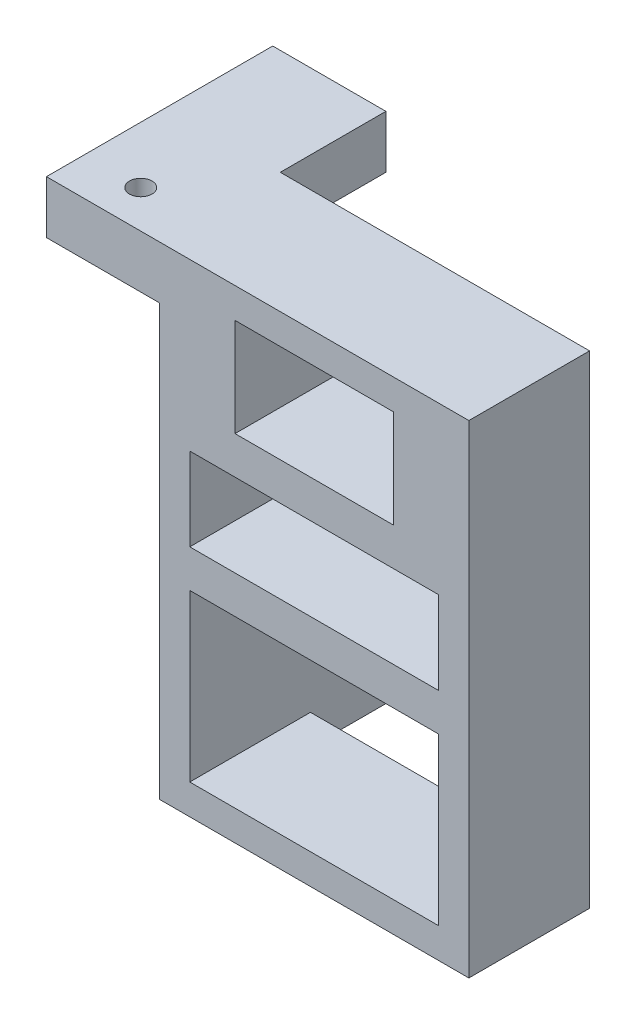
ISO-10303-21;
HEADER;
FILE_DESCRIPTION(('STEP AP214'),'2;1');
FILE_NAME('part.step','',(''),(''),'','','');
FILE_SCHEMA(('AUTOMOTIVE_DESIGN { 1 0 10303 214 1 1 1 1 }'));
ENDSEC;
DATA;
#1=APPLICATION_CONTEXT('core data for automotive mechanical design processes');
#2=APPLICATION_PROTOCOL_DEFINITION('international standard','automotive_design',2000,#1);
#3=PRODUCT_CONTEXT('',#1,'mechanical');
#4=PRODUCT('Part','Part','',(#3));
#5=PRODUCT_RELATED_PRODUCT_CATEGORY('part','',(#4));
#6=PRODUCT_DEFINITION_FORMATION('','',#4);
#7=PRODUCT_DEFINITION_CONTEXT('part definition',#1,'design');
#8=PRODUCT_DEFINITION('design','',#6,#7);
#9=PRODUCT_DEFINITION_SHAPE('','',#8);
#10=(LENGTH_UNIT() NAMED_UNIT(*) SI_UNIT(.MILLI.,.METRE.));
#11=(NAMED_UNIT(*) PLANE_ANGLE_UNIT() SI_UNIT($,.RADIAN.));
#12=(NAMED_UNIT(*) SI_UNIT($,.STERADIAN.) SOLID_ANGLE_UNIT());
#13=UNCERTAINTY_MEASURE_WITH_UNIT(LENGTH_MEASURE(1.E-05),#10,'distance_accuracy_value','');
#14=(GEOMETRIC_REPRESENTATION_CONTEXT(3) GLOBAL_UNCERTAINTY_ASSIGNED_CONTEXT((#13)) GLOBAL_UNIT_ASSIGNED_CONTEXT((#10,
#11,#12)) REPRESENTATION_CONTEXT('',''));
#15=CARTESIAN_POINT('',(0.,0.,0.));
#16=DIRECTION('',(0.,0.,1.));
#17=DIRECTION('',(1.,0.,0.));
#18=AXIS2_PLACEMENT_3D('',#15,#16,#17);
#19=CARTESIAN_POINT('',(0.,0.,0.));
#20=DIRECTION('',(0.,0.,1.));
#21=DIRECTION('',(1.,0.,0.));
#22=AXIS2_PLACEMENT_3D('',#19,#20,#21);
#23=PLANE('',#22);
#24=DIRECTION('',(0.,-1.,0.));
#25=VECTOR('',#24,1.);
#26=CARTESIAN_POINT('',(-93.4942398194444,40.0277777777778,0.));
#27=LINE('',#26,#25);
#28=CARTESIAN_POINT('',(-93.4942398194444,40.0277777777778,0.));
#29=VERTEX_POINT('',#28);
#30=CARTESIAN_POINT('',(-93.4942398194444,27.0277777777778,0.));
#31=VERTEX_POINT('',#30);
#32=EDGE_CURVE('E332',#29,#31,#27,.T.);
#33=ORIENTED_EDGE('',*,*,#32,.T.);
#34=DIRECTION('',(1.,0.,0.));
#35=VECTOR('',#34,1.);
#36=CARTESIAN_POINT('',(-93.4942398194444,27.0277777777778,0.));
#37=LINE('',#36,#35);
#38=CARTESIAN_POINT('',(-72.4942398194444,27.0277777777778,0.));
#39=VERTEX_POINT('',#38);
#40=EDGE_CURVE('E335',#31,#39,#37,.T.);
#41=ORIENTED_EDGE('',*,*,#40,.T.);
#42=DIRECTION('',(0.,1.,0.));
#43=VECTOR('',#42,1.);
#44=CARTESIAN_POINT('',(-72.4942398194444,40.0277777777778,0.));
#45=LINE('',#44,#43);
#46=CARTESIAN_POINT('',(-72.4942398194444,40.0277777777778,0.));
#47=VERTEX_POINT('',#46);
#48=EDGE_CURVE('E338',#39,#47,#45,.T.);
#49=ORIENTED_EDGE('',*,*,#48,.T.);
#50=DIRECTION('',(-1.,0.,0.));
#51=VECTOR('',#50,1.);
#52=CARTESIAN_POINT('',(-93.4942398194444,40.0277777777778,0.));
#53=LINE('',#52,#51);
#54=EDGE_CURVE('E324',#47,#29,#53,.T.);
#55=ORIENTED_EDGE('',*,*,#54,.T.);
#56=EDGE_LOOP('',(#33,#41,#49,#55));
#57=FACE_BOUND('',#56,.T.);
#58=DIRECTION('',(1.,0.,0.));
#59=VECTOR('',#58,1.);
#60=CARTESIAN_POINT('',(-99.4942398194445,16.0277777777778,0.));
#61=LINE('',#60,#59);
#62=CARTESIAN_POINT('',(-103.494239819444,16.0277777777778,0.));
#63=VERTEX_POINT('',#62);
#64=CARTESIAN_POINT('',(-99.4942398194444,16.0277777777778,0.));
#65=VERTEX_POINT('',#64);
#66=EDGE_CURVE('E50',#63,#65,#61,.T.);
#67=ORIENTED_EDGE('',*,*,#66,.F.);
#68=DIRECTION('',(0.,-1.,0.));
#69=VECTOR('',#68,1.);
#70=CARTESIAN_POINT('',(-103.494239819444,44.0277777777778,0.));
#71=LINE('',#70,#69);
#72=CARTESIAN_POINT('',(-103.494239819444,37.0277777777778,0.));
#73=VERTEX_POINT('',#72);
#74=EDGE_CURVE('E282',#73,#63,#71,.T.);
#75=ORIENTED_EDGE('',*,*,#74,.F.);
#76=CARTESIAN_POINT('',(-103.494239819444,44.0277777777778,0.));
#77=VERTEX_POINT('',#76);
#78=EDGE_CURVE('E285',#77,#73,#71,.T.);
#79=ORIENTED_EDGE('',*,*,#78,.F.);
#80=DIRECTION('',(-1.,0.,0.));
#81=VECTOR('',#80,1.);
#82=CARTESIAN_POINT('',(-103.494239819444,44.0277777777778,0.));
#83=LINE('',#82,#81);
#84=CARTESIAN_POINT('',(-62.4942398194444,44.0277777777778,0.));
#85=VERTEX_POINT('',#84);
#86=EDGE_CURVE('E270',#85,#77,#83,.T.);
#87=ORIENTED_EDGE('',*,*,#86,.F.);
#88=DIRECTION('',(0.,1.,0.));
#89=VECTOR('',#88,1.);
#90=CARTESIAN_POINT('',(-62.4942398194444,44.0277777777778,0.));
#91=LINE('',#90,#89);
#92=CARTESIAN_POINT('',(-62.4942398194444,-19.9722222222222,0.));
#93=VERTEX_POINT('',#92);
#94=EDGE_CURVE('E429',#93,#85,#91,.T.);
#95=ORIENTED_EDGE('',*,*,#94,.F.);
#96=DIRECTION('',(1.,0.,0.));
#97=VECTOR('',#96,1.);
#98=CARTESIAN_POINT('',(-103.494239819444,-19.9722222222222,0.));
#99=LINE('',#98,#97);
#100=CARTESIAN_POINT('',(-99.4942398194445,-19.9722222222222,0.));
#101=VERTEX_POINT('',#100);
#102=EDGE_CURVE('E57',#101,#93,#99,.T.);
#103=ORIENTED_EDGE('',*,*,#102,.F.);
#104=DIRECTION('',(0.,-1.,0.));
#105=VECTOR('',#104,1.);
#106=CARTESIAN_POINT('',(-99.4942398194445,-19.9722222222222,0.));
#107=LINE('',#106,#105);
#108=CARTESIAN_POINT('',(-99.4942398194445,-15.9722222222222,0.));
#109=VERTEX_POINT('',#108);
#110=EDGE_CURVE('E410',#109,#101,#107,.T.);
#111=ORIENTED_EDGE('',*,*,#110,.F.);
#112=DIRECTION('',(1.,0.,0.));
#113=VECTOR('',#112,1.);
#114=CARTESIAN_POINT('',(-99.4942398194445,-15.9722222222222,0.));
#115=LINE('',#114,#113);
#116=CARTESIAN_POINT('',(-66.4942398194444,-15.9722222222222,0.));
#117=VERTEX_POINT('',#116);
#118=EDGE_CURVE('E381',#109,#117,#115,.T.);
#119=ORIENTED_EDGE('',*,*,#118,.T.);
#120=DIRECTION('',(0.,1.,0.));
#121=VECTOR('',#120,1.);
#122=CARTESIAN_POINT('',(-66.4942398194445,6.02777777777779,0.));
#123=LINE('',#122,#121);
#124=CARTESIAN_POINT('',(-66.4942398194445,6.02777777777779,0.));
#125=VERTEX_POINT('',#124);
#126=EDGE_CURVE('E395',#117,#125,#123,.T.);
#127=ORIENTED_EDGE('',*,*,#126,.T.);
#128=DIRECTION('',(-1.,0.,0.));
#129=VECTOR('',#128,1.);
#130=CARTESIAN_POINT('',(-99.4942398194445,6.02777777777779,0.));
#131=LINE('',#130,#129);
#132=CARTESIAN_POINT('',(-99.4942398194445,6.02777777777779,0.));
#133=VERTEX_POINT('',#132);
#134=EDGE_CURVE('E385',#125,#133,#131,.T.);
#135=ORIENTED_EDGE('',*,*,#134,.T.);
#136=CARTESIAN_POINT('',(-99.4942398194445,11.0277777777778,0.));
#137=VERTEX_POINT('',#136);
#138=EDGE_CURVE('E252',#137,#133,#107,.T.);
#139=ORIENTED_EDGE('',*,*,#138,.F.);
#140=DIRECTION('',(1.,0.,0.));
#141=VECTOR('',#140,1.);
#142=CARTESIAN_POINT('',(-99.4942398194444,11.0277777777778,0.));
#143=LINE('',#142,#141);
#144=CARTESIAN_POINT('',(-66.4942398194444,11.0277777777778,0.));
#145=VERTEX_POINT('',#144);
#146=EDGE_CURVE('E365',#137,#145,#143,.T.);
#147=ORIENTED_EDGE('',*,*,#146,.T.);
#148=DIRECTION('',(0.,1.,0.));
#149=VECTOR('',#148,1.);
#150=CARTESIAN_POINT('',(-66.4942398194444,11.0277777777778,0.));
#151=LINE('',#150,#149);
#152=CARTESIAN_POINT('',(-66.4942398194444,22.0277777777778,0.));
#153=VERTEX_POINT('',#152);
#154=EDGE_CURVE('E368',#145,#153,#151,.T.);
#155=ORIENTED_EDGE('',*,*,#154,.T.);
#156=DIRECTION('',(-1.,0.,0.));
#157=VECTOR('',#156,1.);
#158=CARTESIAN_POINT('',(-99.4942398194444,22.0277777777778,0.));
#159=LINE('',#158,#157);
#160=CARTESIAN_POINT('',(-99.4942398194444,22.0277777777778,0.));
#161=VERTEX_POINT('',#160);
#162=EDGE_CURVE('E356',#153,#161,#159,.T.);
#163=ORIENTED_EDGE('',*,*,#162,.T.);
#164=DIRECTION('',(0.,-1.,0.));
#165=VECTOR('',#164,1.);
#166=CARTESIAN_POINT('',(-99.4942398194444,11.0277777777778,0.));
#167=LINE('',#166,#165);
#168=EDGE_CURVE('E352',#161,#65,#167,.T.);
#169=ORIENTED_EDGE('',*,*,#168,.T.);
#170=EDGE_LOOP('',(#67,#75,#79,#87,#95,#103,#111,#119,#127,#135,#139,#147,#155,#163,#169));
#171=FACE_BOUND('',#170,.T.);
#172=ADVANCED_FACE('F33',(#57,#171),#23,.F.);
#173=CARTESIAN_POINT('',(-103.494239819444,44.0277777777778,16.));
#174=DIRECTION('',(1.,0.,0.));
#175=DIRECTION('',(0.,1.,0.));
#176=AXIS2_PLACEMENT_3D('',#173,#174,#175);
#177=PLANE('',#176);
#178=DIRECTION('',(0.,0.,1.));
#179=VECTOR('',#178,1.);
#180=CARTESIAN_POINT('',(-103.494239819444,37.0277777777778,16.));
#181=LINE('',#180,#179);
#182=CARTESIAN_POINT('',(-103.494239819444,37.0277777777778,16.));
#183=VERTEX_POINT('',#182);
#184=EDGE_CURVE('E11',#73,#183,#181,.T.);
#185=ORIENTED_EDGE('',*,*,#184,.F.);
#186=ORIENTED_EDGE('',*,*,#74,.T.);
#187=DIRECTION('',(0.,0.,1.));
#188=VECTOR('',#187,1.);
#189=CARTESIAN_POINT('',(-103.494239819444,16.0277777777778,-22.));
#190=LINE('',#189,#188);
#191=CARTESIAN_POINT('',(-103.494239819444,16.0277777777778,-22.));
#192=VERTEX_POINT('',#191);
#193=EDGE_CURVE('E291',#192,#63,#190,.T.);
#194=ORIENTED_EDGE('',*,*,#193,.F.);
#195=DIRECTION('',(0.,1.,0.));
#196=VECTOR('',#195,1.);
#197=CARTESIAN_POINT('',(-103.494239819444,-19.9722222222222,-22.));
#198=LINE('',#197,#196);
#199=CARTESIAN_POINT('',(-103.494239819444,-19.9722222222222,-22.));
#200=VERTEX_POINT('',#199);
#201=EDGE_CURVE('E249',#200,#192,#198,.T.);
#202=ORIENTED_EDGE('',*,*,#201,.F.);
#203=DIRECTION('',(0.,0.,-1.));
#204=VECTOR('',#203,1.);
#205=CARTESIAN_POINT('',(-103.494239819444,-19.9722222222222,16.));
#206=LINE('',#205,#204);
#207=CARTESIAN_POINT('',(-103.494239819444,-19.9722222222222,16.));
#208=VERTEX_POINT('',#207);
#209=EDGE_CURVE('E42',#208,#200,#206,.T.);
#210=ORIENTED_EDGE('',*,*,#209,.F.);
#211=DIRECTION('',(0.,-1.,0.));
#212=VECTOR('',#211,1.);
#213=CARTESIAN_POINT('',(-103.494239819444,44.0277777777778,16.));
#214=LINE('',#213,#212);
#215=EDGE_CURVE('E267',#183,#208,#214,.T.);
#216=ORIENTED_EDGE('',*,*,#215,.F.);
#217=EDGE_LOOP('',(#185,#186,#194,#202,#210,#216));
#218=FACE_BOUND('',#217,.T.);
#219=ADVANCED_FACE('F35',(#218),#177,.F.);
#220=CARTESIAN_POINT('',(0.,0.,16.));
#221=DIRECTION('',(0.,0.,1.));
#222=DIRECTION('',(1.,0.,0.));
#223=AXIS2_PLACEMENT_3D('',#220,#221,#222);
#224=PLANE('',#223);
#225=DIRECTION('',(-1.,0.,0.));
#226=VECTOR('',#225,1.);
#227=CARTESIAN_POINT('',(-103.494239819444,44.0277777777778,16.));
#228=LINE('',#227,#226);
#229=CARTESIAN_POINT('',(-62.4942398194444,44.0277777777778,16.));
#230=VERTEX_POINT('',#229);
#231=CARTESIAN_POINT('',(-118.494239819444,44.0277777777778,16.));
#232=VERTEX_POINT('',#231);
#233=EDGE_CURVE('E263',#230,#232,#228,.T.);
#234=ORIENTED_EDGE('',*,*,#233,.T.);
#235=DIRECTION('',(0.,1.,0.));
#236=VECTOR('',#235,1.);
#237=CARTESIAN_POINT('',(-118.494239819444,37.0277777777778,16.));
#238=LINE('',#237,#236);
#239=CARTESIAN_POINT('',(-118.494239819444,37.0277777777778,16.));
#240=VERTEX_POINT('',#239);
#241=EDGE_CURVE('E304',#240,#232,#238,.T.);
#242=ORIENTED_EDGE('',*,*,#241,.F.);
#243=DIRECTION('',(1.,0.,0.));
#244=VECTOR('',#243,1.);
#245=CARTESIAN_POINT('',(-118.494239819444,37.0277777777778,16.));
#246=LINE('',#245,#244);
#247=EDGE_CURVE('E314',#240,#183,#246,.T.);
#248=ORIENTED_EDGE('',*,*,#247,.T.);
#249=ORIENTED_EDGE('',*,*,#215,.T.);
#250=DIRECTION('',(1.,0.,0.));
#251=VECTOR('',#250,1.);
#252=CARTESIAN_POINT('',(-103.494239819444,-19.9722222222222,16.));
#253=LINE('',#252,#251);
#254=CARTESIAN_POINT('',(-62.4942398194444,-19.9722222222222,16.));
#255=VERTEX_POINT('',#254);
#256=EDGE_CURVE('E269',#208,#255,#253,.T.);
#257=ORIENTED_EDGE('',*,*,#256,.T.);
#258=DIRECTION('',(0.,1.,0.));
#259=VECTOR('',#258,1.);
#260=CARTESIAN_POINT('',(-62.4942398194444,44.0277777777778,16.));
#261=LINE('',#260,#259);
#262=EDGE_CURVE('E279',#255,#230,#261,.T.);
#263=ORIENTED_EDGE('',*,*,#262,.T.);
#264=EDGE_LOOP('',(#234,#242,#248,#249,#257,#263));
#265=FACE_BOUND('',#264,.T.);
#266=DIRECTION('',(1.,0.,0.));
#267=VECTOR('',#266,1.);
#268=CARTESIAN_POINT('',(-99.4942398194445,-15.9722222222222,16.));
#269=LINE('',#268,#267);
#270=CARTESIAN_POINT('',(-99.4942398194445,-15.9722222222222,16.));
#271=VERTEX_POINT('',#270);
#272=CARTESIAN_POINT('',(-66.4942398194444,-15.9722222222222,16.));
#273=VERTEX_POINT('',#272);
#274=EDGE_CURVE('E384',#271,#273,#269,.T.);
#275=ORIENTED_EDGE('',*,*,#274,.F.);
#276=DIRECTION('',(0.,-1.,0.));
#277=VECTOR('',#276,1.);
#278=CARTESIAN_POINT('',(-99.4942398194445,6.02777777777779,16.));
#279=LINE('',#278,#277);
#280=CARTESIAN_POINT('',(-99.4942398194445,6.02777777777779,16.));
#281=VERTEX_POINT('',#280);
#282=EDGE_CURVE('E382',#281,#271,#279,.T.);
#283=ORIENTED_EDGE('',*,*,#282,.F.);
#284=DIRECTION('',(-1.,0.,0.));
#285=VECTOR('',#284,1.);
#286=CARTESIAN_POINT('',(-99.4942398194445,6.02777777777779,16.));
#287=LINE('',#286,#285);
#288=CARTESIAN_POINT('',(-66.4942398194445,6.02777777777779,16.));
#289=VERTEX_POINT('',#288);
#290=EDGE_CURVE('E390',#289,#281,#287,.T.);
#291=ORIENTED_EDGE('',*,*,#290,.F.);
#292=DIRECTION('',(0.,1.,0.));
#293=VECTOR('',#292,1.);
#294=CARTESIAN_POINT('',(-66.4942398194445,6.02777777777779,16.));
#295=LINE('',#294,#293);
#296=EDGE_CURVE('E387',#273,#289,#295,.T.);
#297=ORIENTED_EDGE('',*,*,#296,.F.);
#298=EDGE_LOOP('',(#275,#283,#291,#297));
#299=FACE_BOUND('',#298,.T.);
#300=DIRECTION('',(1.,0.,0.));
#301=VECTOR('',#300,1.);
#302=CARTESIAN_POINT('',(-99.4942398194444,11.0277777777778,16.));
#303=LINE('',#302,#301);
#304=CARTESIAN_POINT('',(-99.4942398194444,11.0277777777778,16.));
#305=VERTEX_POINT('',#304);
#306=CARTESIAN_POINT('',(-66.4942398194444,11.0277777777778,16.));
#307=VERTEX_POINT('',#306);
#308=EDGE_CURVE('E355',#305,#307,#303,.T.);
#309=ORIENTED_EDGE('',*,*,#308,.F.);
#310=DIRECTION('',(0.,-1.,0.));
#311=VECTOR('',#310,1.);
#312=CARTESIAN_POINT('',(-99.4942398194444,11.0277777777778,16.));
#313=LINE('',#312,#311);
#314=CARTESIAN_POINT('',(-99.4942398194444,22.0277777777778,16.));
#315=VERTEX_POINT('',#314);
#316=EDGE_CURVE('E353',#315,#305,#313,.T.);
#317=ORIENTED_EDGE('',*,*,#316,.F.);
#318=DIRECTION('',(-1.,0.,0.));
#319=VECTOR('',#318,1.);
#320=CARTESIAN_POINT('',(-99.4942398194444,22.0277777777778,16.));
#321=LINE('',#320,#319);
#322=CARTESIAN_POINT('',(-66.4942398194444,22.0277777777778,16.));
#323=VERTEX_POINT('',#322);
#324=EDGE_CURVE('E361',#323,#315,#321,.T.);
#325=ORIENTED_EDGE('',*,*,#324,.F.);
#326=DIRECTION('',(0.,1.,0.));
#327=VECTOR('',#326,1.);
#328=CARTESIAN_POINT('',(-66.4942398194444,11.0277777777778,16.));
#329=LINE('',#328,#327);
#330=EDGE_CURVE('E358',#307,#323,#329,.T.);
#331=ORIENTED_EDGE('',*,*,#330,.F.);
#332=EDGE_LOOP('',(#309,#317,#325,#331));
#333=FACE_BOUND('',#332,.T.);
#334=DIRECTION('',(1.,0.,0.));
#335=VECTOR('',#334,1.);
#336=CARTESIAN_POINT('',(-93.4942398194444,27.0277777777778,16.));
#337=LINE('',#336,#335);
#338=CARTESIAN_POINT('',(-93.4942398194444,27.0277777777778,16.));
#339=VERTEX_POINT('',#338);
#340=CARTESIAN_POINT('',(-72.4942398194444,27.0277777777778,16.));
#341=VERTEX_POINT('',#340);
#342=EDGE_CURVE('E323',#339,#341,#337,.T.);
#343=ORIENTED_EDGE('',*,*,#342,.F.);
#344=DIRECTION('',(0.,-1.,0.));
#345=VECTOR('',#344,1.);
#346=CARTESIAN_POINT('',(-93.4942398194444,40.0277777777778,16.));
#347=LINE('',#346,#345);
#348=CARTESIAN_POINT('',(-93.4942398194444,40.0277777777778,16.));
#349=VERTEX_POINT('',#348);
#350=EDGE_CURVE('E321',#349,#339,#347,.T.);
#351=ORIENTED_EDGE('',*,*,#350,.F.);
#352=DIRECTION('',(-1.,0.,0.));
#353=VECTOR('',#352,1.);
#354=CARTESIAN_POINT('',(-93.4942398194444,40.0277777777778,16.));
#355=LINE('',#354,#353);
#356=CARTESIAN_POINT('',(-72.4942398194444,40.0277777777778,16.));
#357=VERTEX_POINT('',#356);
#358=EDGE_CURVE('E329',#357,#349,#355,.T.);
#359=ORIENTED_EDGE('',*,*,#358,.F.);
#360=DIRECTION('',(0.,1.,0.));
#361=VECTOR('',#360,1.);
#362=CARTESIAN_POINT('',(-72.4942398194444,40.0277777777778,16.));
#363=LINE('',#362,#361);
#364=EDGE_CURVE('E326',#341,#357,#363,.T.);
#365=ORIENTED_EDGE('',*,*,#364,.F.);
#366=EDGE_LOOP('',(#343,#351,#359,#365));
#367=FACE_BOUND('',#366,.T.);
#368=ADVANCED_FACE('F417',(#265,#299,#333,#367),#224,.T.);
#369=CARTESIAN_POINT('',(-103.494239819444,-19.9722222222222,16.));
#370=DIRECTION('',(0.,1.,0.));
#371=DIRECTION('',(0.,0.,1.));
#372=AXIS2_PLACEMENT_3D('',#369,#370,#371);
#373=PLANE('',#372);
#374=ORIENTED_EDGE('',*,*,#209,.T.);
#375=DIRECTION('',(1.,0.,0.));
#376=VECTOR('',#375,1.);
#377=CARTESIAN_POINT('',(-118.494239819444,-19.9722222222222,-22.));
#378=LINE('',#377,#376);
#379=CARTESIAN_POINT('',(-118.494239819444,-19.9722222222222,-22.));
#380=VERTEX_POINT('',#379);
#381=EDGE_CURVE('E199',#380,#200,#378,.T.);
#382=ORIENTED_EDGE('',*,*,#381,.F.);
#383=DIRECTION('',(0.,0.,-1.));
#384=VECTOR('',#383,1.);
#385=CARTESIAN_POINT('',(-118.494239819444,-19.9722222222222,-22.));
#386=LINE('',#385,#384);
#387=CARTESIAN_POINT('',(-118.494239819444,-19.9722222222222,-26.));
#388=VERTEX_POINT('',#387);
#389=EDGE_CURVE('E203',#380,#388,#386,.T.);
#390=ORIENTED_EDGE('',*,*,#389,.T.);
#391=DIRECTION('',(1.,0.,0.));
#392=VECTOR('',#391,1.);
#393=CARTESIAN_POINT('',(-118.494239819444,-19.9722222222222,-26.));
#394=LINE('',#393,#392);
#395=CARTESIAN_POINT('',(-99.4942398194445,-19.9722222222222,-26.));
#396=VERTEX_POINT('',#395);
#397=EDGE_CURVE('E210',#388,#396,#394,.T.);
#398=ORIENTED_EDGE('',*,*,#397,.T.);
#399=DIRECTION('',(0.,0.,1.));
#400=VECTOR('',#399,1.);
#401=CARTESIAN_POINT('',(-99.4942398194445,-19.9722222222222,-22.));
#402=LINE('',#401,#400);
#403=EDGE_CURVE('E251',#396,#101,#402,.T.);
#404=ORIENTED_EDGE('',*,*,#403,.T.);
#405=ORIENTED_EDGE('',*,*,#102,.T.);
#406=DIRECTION('',(0.,0.,-1.));
#407=VECTOR('',#406,1.);
#408=CARTESIAN_POINT('',(-62.4942398194444,-19.9722222222222,16.));
#409=LINE('',#408,#407);
#410=EDGE_CURVE('E255',#255,#93,#409,.T.);
#411=ORIENTED_EDGE('',*,*,#410,.F.);
#412=ORIENTED_EDGE('',*,*,#256,.F.);
#413=EDGE_LOOP('',(#374,#382,#390,#398,#404,#405,#411,#412));
#414=FACE_BOUND('',#413,.T.);
#415=ADVANCED_FACE('F201',(#414),#373,.F.);
#416=CARTESIAN_POINT('',(-62.4942398194444,44.0277777777778,16.));
#417=DIRECTION('',(-1.,0.,0.));
#418=DIRECTION('',(0.,-1.,0.));
#419=AXIS2_PLACEMENT_3D('',#416,#417,#418);
#420=PLANE('',#419);
#421=ORIENTED_EDGE('',*,*,#94,.T.);
#422=DIRECTION('',(0.,0.,-1.));
#423=VECTOR('',#422,1.);
#424=CARTESIAN_POINT('',(-62.4942398194444,44.0277777777778,16.));
#425=LINE('',#424,#423);
#426=EDGE_CURVE('E257',#230,#85,#425,.T.);
#427=ORIENTED_EDGE('',*,*,#426,.F.);
#428=ORIENTED_EDGE('',*,*,#262,.F.);
#429=ORIENTED_EDGE('',*,*,#410,.T.);
#430=EDGE_LOOP('',(#421,#427,#428,#429));
#431=FACE_BOUND('',#430,.T.);
#432=ADVANCED_FACE('F465',(#431),#420,.F.);
#433=CARTESIAN_POINT('',(-103.494239819444,44.0277777777778,16.));
#434=DIRECTION('',(0.,-1.,0.));
#435=DIRECTION('',(1.,0.,0.));
#436=AXIS2_PLACEMENT_3D('',#433,#434,#435);
#437=PLANE('',#436);
#438=CARTESIAN_POINT('',(-110.994239819444,44.0277777777778,11.));
#439=DIRECTION('',(0.,1.,0.));
#440=DIRECTION('',(-1.,0.,0.));
#441=AXIS2_PLACEMENT_3D('',#438,#439,#440);
#442=CIRCLE('',#441,1.5);
#443=CARTESIAN_POINT('',(-112.494239819444,44.0277777777778,11.));
#444=VERTEX_POINT('',#443);
#445=EDGE_CURVE('E232',#444,#444,#442,.T.);
#446=ORIENTED_EDGE('',*,*,#445,.F.);
#447=EDGE_LOOP('',(#446));
#448=FACE_BOUND('',#447,.T.);
#449=ORIENTED_EDGE('',*,*,#86,.T.);
#450=DIRECTION('',(0.,0.,-1.));
#451=VECTOR('',#450,1.);
#452=CARTESIAN_POINT('',(-103.494239819444,44.0277777777778,16.));
#453=LINE('',#452,#451);
#454=CARTESIAN_POINT('',(-103.494239819444,44.0277777777778,-14.));
#455=VERTEX_POINT('',#454);
#456=EDGE_CURVE('E293',#77,#455,#453,.T.);
#457=ORIENTED_EDGE('',*,*,#456,.T.);
#458=DIRECTION('',(1.,0.,0.));
#459=VECTOR('',#458,1.);
#460=CARTESIAN_POINT('',(-118.494239819444,44.0277777777778,-14.));
#461=LINE('',#460,#459);
#462=CARTESIAN_POINT('',(-118.494239819444,44.0277777777778,-14.));
#463=VERTEX_POINT('',#462);
#464=EDGE_CURVE('E319',#463,#455,#461,.T.);
#465=ORIENTED_EDGE('',*,*,#464,.F.);
#466=DIRECTION('',(0.,0.,-1.));
#467=VECTOR('',#466,1.);
#468=CARTESIAN_POINT('',(-118.494239819444,44.0277777777778,16.));
#469=LINE('',#468,#467);
#470=EDGE_CURVE('E307',#232,#463,#469,.T.);
#471=ORIENTED_EDGE('',*,*,#470,.F.);
#472=ORIENTED_EDGE('',*,*,#233,.F.);
#473=ORIENTED_EDGE('',*,*,#426,.T.);
#474=EDGE_LOOP('',(#449,#457,#465,#471,#472,#473));
#475=FACE_BOUND('',#474,.T.);
#476=ADVANCED_FACE('F463',(#448,#475),#437,.F.);
#477=CARTESIAN_POINT('',(-99.4942398194445,6.02777777777779,16.));
#478=DIRECTION('',(1.,0.,0.));
#479=DIRECTION('',(0.,0.,-1.));
#480=AXIS2_PLACEMENT_3D('',#477,#478,#479);
#481=PLANE('',#480);
#482=DIRECTION('',(0.,0.,-1.));
#483=VECTOR('',#482,1.);
#484=CARTESIAN_POINT('',(-99.4942398194445,-15.9722222222222,16.));
#485=LINE('',#484,#483);
#486=EDGE_CURVE('E276',#271,#109,#485,.T.);
#487=ORIENTED_EDGE('',*,*,#486,.T.);
#488=ORIENTED_EDGE('',*,*,#110,.T.);
#489=ORIENTED_EDGE('',*,*,#403,.F.);
#490=DIRECTION('',(0.,1.,0.));
#491=VECTOR('',#490,1.);
#492=CARTESIAN_POINT('',(-99.4942398194445,16.0277777777778,-26.));
#493=LINE('',#492,#491);
#494=CARTESIAN_POINT('',(-99.4942398194445,16.0277777777778,-26.));
#495=VERTEX_POINT('',#494);
#496=EDGE_CURVE('E226',#396,#495,#493,.T.);
#497=ORIENTED_EDGE('',*,*,#496,.T.);
#498=DIRECTION('',(0.,0.,1.));
#499=VECTOR('',#498,1.);
#500=CARTESIAN_POINT('',(-99.4942398194445,16.0277777777778,-22.));
#501=LINE('',#500,#499);
#502=EDGE_CURVE('E294',#495,#65,#501,.T.);
#503=ORIENTED_EDGE('',*,*,#502,.T.);
#504=ORIENTED_EDGE('',*,*,#168,.F.);
#505=DIRECTION('',(0.,0.,-1.));
#506=VECTOR('',#505,1.);
#507=CARTESIAN_POINT('',(-99.4942398194444,22.0277777777778,16.));
#508=LINE('',#507,#506);
#509=EDGE_CURVE('E363',#315,#161,#508,.T.);
#510=ORIENTED_EDGE('',*,*,#509,.F.);
#511=ORIENTED_EDGE('',*,*,#316,.T.);
#512=DIRECTION('',(0.,0.,-1.));
#513=VECTOR('',#512,1.);
#514=CARTESIAN_POINT('',(-99.4942398194444,11.0277777777778,16.));
#515=LINE('',#514,#513);
#516=EDGE_CURVE('E379',#305,#137,#515,.T.);
#517=ORIENTED_EDGE('',*,*,#516,.T.);
#518=ORIENTED_EDGE('',*,*,#138,.T.);
#519=DIRECTION('',(0.,0.,-1.));
#520=VECTOR('',#519,1.);
#521=CARTESIAN_POINT('',(-99.4942398194445,6.02777777777779,16.));
#522=LINE('',#521,#520);
#523=EDGE_CURVE('E392',#281,#133,#522,.T.);
#524=ORIENTED_EDGE('',*,*,#523,.F.);
#525=ORIENTED_EDGE('',*,*,#282,.T.);
#526=EDGE_LOOP('',(#487,#488,#489,#497,#503,#504,#510,#511,#517,#518,#524,#525));
#527=FACE_BOUND('',#526,.T.);
#528=ADVANCED_FACE('F409',(#527),#481,.T.);
#529=CARTESIAN_POINT('',(-99.4942398194445,-15.9722222222222,16.));
#530=DIRECTION('',(0.,1.,0.));
#531=DIRECTION('',(-1.,0.,0.));
#532=AXIS2_PLACEMENT_3D('',#529,#530,#531);
#533=PLANE('',#532);
#534=ORIENTED_EDGE('',*,*,#118,.F.);
#535=ORIENTED_EDGE('',*,*,#486,.F.);
#536=ORIENTED_EDGE('',*,*,#274,.T.);
#537=DIRECTION('',(0.,0.,-1.));
#538=VECTOR('',#537,1.);
#539=CARTESIAN_POINT('',(-66.4942398194444,-15.9722222222222,16.));
#540=LINE('',#539,#538);
#541=EDGE_CURVE('E402',#273,#117,#540,.T.);
#542=ORIENTED_EDGE('',*,*,#541,.T.);
#543=EDGE_LOOP('',(#534,#535,#536,#542));
#544=FACE_BOUND('',#543,.T.);
#545=ADVANCED_FACE('F414',(#544),#533,.T.);
#546=CARTESIAN_POINT('',(-66.4942398194445,6.02777777777779,16.));
#547=DIRECTION('',(-1.,0.,0.));
#548=DIRECTION('',(0.,-1.,0.));
#549=AXIS2_PLACEMENT_3D('',#546,#547,#548);
#550=PLANE('',#549);
#551=ORIENTED_EDGE('',*,*,#126,.F.);
#552=ORIENTED_EDGE('',*,*,#541,.F.);
#553=ORIENTED_EDGE('',*,*,#296,.T.);
#554=DIRECTION('',(0.,0.,-1.));
#555=VECTOR('',#554,1.);
#556=CARTESIAN_POINT('',(-66.4942398194445,6.02777777777779,16.));
#557=LINE('',#556,#555);
#558=EDGE_CURVE('E401',#289,#125,#557,.T.);
#559=ORIENTED_EDGE('',*,*,#558,.T.);
#560=EDGE_LOOP('',(#551,#552,#553,#559));
#561=FACE_BOUND('',#560,.T.);
#562=ADVANCED_FACE('F421',(#561),#550,.T.);
#563=CARTESIAN_POINT('',(-99.4942398194445,6.02777777777779,16.));
#564=DIRECTION('',(0.,-1.,0.));
#565=DIRECTION('',(0.,0.,-1.));
#566=AXIS2_PLACEMENT_3D('',#563,#564,#565);
#567=PLANE('',#566);
#568=ORIENTED_EDGE('',*,*,#134,.F.);
#569=ORIENTED_EDGE('',*,*,#558,.F.);
#570=ORIENTED_EDGE('',*,*,#290,.T.);
#571=ORIENTED_EDGE('',*,*,#523,.T.);
#572=EDGE_LOOP('',(#568,#569,#570,#571));
#573=FACE_BOUND('',#572,.T.);
#574=ADVANCED_FACE('F488',(#573),#567,.T.);
#575=CARTESIAN_POINT('',(-99.4942398194444,11.0277777777778,16.));
#576=DIRECTION('',(0.,1.,0.));
#577=DIRECTION('',(0.,0.,1.));
#578=AXIS2_PLACEMENT_3D('',#575,#576,#577);
#579=PLANE('',#578);
#580=ORIENTED_EDGE('',*,*,#146,.F.);
#581=ORIENTED_EDGE('',*,*,#516,.F.);
#582=ORIENTED_EDGE('',*,*,#308,.T.);
#583=DIRECTION('',(0.,0.,-1.));
#584=VECTOR('',#583,1.);
#585=CARTESIAN_POINT('',(-66.4942398194444,11.0277777777778,16.));
#586=LINE('',#585,#584);
#587=EDGE_CURVE('E377',#307,#145,#586,.T.);
#588=ORIENTED_EDGE('',*,*,#587,.T.);
#589=EDGE_LOOP('',(#580,#581,#582,#588));
#590=FACE_BOUND('',#589,.T.);
#591=ADVANCED_FACE('F491',(#590),#579,.T.);
#592=CARTESIAN_POINT('',(-66.4942398194444,11.0277777777778,16.));
#593=DIRECTION('',(-1.,0.,0.));
#594=DIRECTION('',(0.,0.,1.));
#595=AXIS2_PLACEMENT_3D('',#592,#593,#594);
#596=PLANE('',#595);
#597=ORIENTED_EDGE('',*,*,#154,.F.);
#598=ORIENTED_EDGE('',*,*,#587,.F.);
#599=ORIENTED_EDGE('',*,*,#330,.T.);
#600=DIRECTION('',(0.,0.,-1.));
#601=VECTOR('',#600,1.);
#602=CARTESIAN_POINT('',(-66.4942398194444,22.0277777777778,16.));
#603=LINE('',#602,#601);
#604=EDGE_CURVE('E375',#323,#153,#603,.T.);
#605=ORIENTED_EDGE('',*,*,#604,.T.);
#606=EDGE_LOOP('',(#597,#598,#599,#605));
#607=FACE_BOUND('',#606,.T.);
#608=ADVANCED_FACE('F495',(#607),#596,.T.);
#609=CARTESIAN_POINT('',(-99.4942398194444,22.0277777777778,16.));
#610=DIRECTION('',(0.,-1.,0.));
#611=DIRECTION('',(0.,0.,-1.));
#612=AXIS2_PLACEMENT_3D('',#609,#610,#611);
#613=PLANE('',#612);
#614=ORIENTED_EDGE('',*,*,#162,.F.);
#615=ORIENTED_EDGE('',*,*,#604,.F.);
#616=ORIENTED_EDGE('',*,*,#324,.T.);
#617=ORIENTED_EDGE('',*,*,#509,.T.);
#618=EDGE_LOOP('',(#614,#615,#616,#617));
#619=FACE_BOUND('',#618,.T.);
#620=ADVANCED_FACE('F499',(#619),#613,.T.);
#621=CARTESIAN_POINT('',(-93.4942398194444,40.0277777777778,16.));
#622=DIRECTION('',(1.,0.,0.));
#623=DIRECTION('',(0.,0.,-1.));
#624=AXIS2_PLACEMENT_3D('',#621,#622,#623);
#625=PLANE('',#624);
#626=ORIENTED_EDGE('',*,*,#32,.F.);
#627=DIRECTION('',(0.,0.,-1.));
#628=VECTOR('',#627,1.);
#629=CARTESIAN_POINT('',(-93.4942398194444,40.0277777777778,16.));
#630=LINE('',#629,#628);
#631=EDGE_CURVE('E331',#349,#29,#630,.T.);
#632=ORIENTED_EDGE('',*,*,#631,.F.);
#633=ORIENTED_EDGE('',*,*,#350,.T.);
#634=DIRECTION('',(0.,0.,-1.));
#635=VECTOR('',#634,1.);
#636=CARTESIAN_POINT('',(-93.4942398194444,27.0277777777778,16.));
#637=LINE('',#636,#635);
#638=EDGE_CURVE('E349',#339,#31,#637,.T.);
#639=ORIENTED_EDGE('',*,*,#638,.T.);
#640=EDGE_LOOP('',(#626,#632,#633,#639));
#641=FACE_BOUND('',#640,.T.);
#642=ADVANCED_FACE('F503',(#641),#625,.T.);
#643=CARTESIAN_POINT('',(-93.4942398194444,27.0277777777778,16.));
#644=DIRECTION('',(0.,1.,0.));
#645=DIRECTION('',(0.,0.,1.));
#646=AXIS2_PLACEMENT_3D('',#643,#644,#645);
#647=PLANE('',#646);
#648=ORIENTED_EDGE('',*,*,#40,.F.);
#649=ORIENTED_EDGE('',*,*,#638,.F.);
#650=ORIENTED_EDGE('',*,*,#342,.T.);
#651=DIRECTION('',(0.,0.,-1.));
#652=VECTOR('',#651,1.);
#653=CARTESIAN_POINT('',(-72.4942398194444,27.0277777777778,16.));
#654=LINE('',#653,#652);
#655=EDGE_CURVE('E347',#341,#39,#654,.T.);
#656=ORIENTED_EDGE('',*,*,#655,.T.);
#657=EDGE_LOOP('',(#648,#649,#650,#656));
#658=FACE_BOUND('',#657,.T.);
#659=ADVANCED_FACE('F507',(#658),#647,.T.);
#660=CARTESIAN_POINT('',(-72.4942398194444,40.0277777777778,16.));
#661=DIRECTION('',(-1.,0.,0.));
#662=DIRECTION('',(0.,0.,1.));
#663=AXIS2_PLACEMENT_3D('',#660,#661,#662);
#664=PLANE('',#663);
#665=ORIENTED_EDGE('',*,*,#48,.F.);
#666=ORIENTED_EDGE('',*,*,#655,.F.);
#667=ORIENTED_EDGE('',*,*,#364,.T.);
#668=DIRECTION('',(0.,0.,-1.));
#669=VECTOR('',#668,1.);
#670=CARTESIAN_POINT('',(-72.4942398194444,40.0277777777778,16.));
#671=LINE('',#670,#669);
#672=EDGE_CURVE('E345',#357,#47,#671,.T.);
#673=ORIENTED_EDGE('',*,*,#672,.T.);
#674=EDGE_LOOP('',(#665,#666,#667,#673));
#675=FACE_BOUND('',#674,.T.);
#676=ADVANCED_FACE('F511',(#675),#664,.T.);
#677=CARTESIAN_POINT('',(-93.4942398194444,40.0277777777778,16.));
#678=DIRECTION('',(0.,-1.,0.));
#679=DIRECTION('',(0.,0.,-1.));
#680=AXIS2_PLACEMENT_3D('',#677,#678,#679);
#681=PLANE('',#680);
#682=ORIENTED_EDGE('',*,*,#54,.F.);
#683=ORIENTED_EDGE('',*,*,#672,.F.);
#684=ORIENTED_EDGE('',*,*,#358,.T.);
#685=ORIENTED_EDGE('',*,*,#631,.T.);
#686=EDGE_LOOP('',(#682,#683,#684,#685));
#687=FACE_BOUND('',#686,.T.);
#688=ADVANCED_FACE('F515',(#687),#681,.T.);
#689=CARTESIAN_POINT('',(-103.494239819444,0.,0.));
#690=DIRECTION('',(-1.,0.,0.));
#691=DIRECTION('',(0.,0.,1.));
#692=AXIS2_PLACEMENT_3D('',#689,#690,#691);
#693=PLANE('',#692);
#694=ORIENTED_EDGE('',*,*,#456,.F.);
#695=ORIENTED_EDGE('',*,*,#78,.T.);
#696=CARTESIAN_POINT('',(-103.494239819444,37.0277777777778,-14.));
#697=VERTEX_POINT('',#696);
#698=EDGE_CURVE('E308',#697,#73,#181,.T.);
#699=ORIENTED_EDGE('',*,*,#698,.F.);
#700=DIRECTION('',(0.,-1.,0.));
#701=VECTOR('',#700,1.);
#702=CARTESIAN_POINT('',(-103.494239819444,37.0277777777778,-14.));
#703=LINE('',#702,#701);
#704=EDGE_CURVE('E296',#455,#697,#703,.T.);
#705=ORIENTED_EDGE('',*,*,#704,.F.);
#706=EDGE_LOOP('',(#694,#695,#699,#705));
#707=FACE_BOUND('',#706,.T.);
#708=ADVANCED_FACE('F456',(#707),#693,.F.);
#709=CARTESIAN_POINT('',(-118.494239819444,37.0277777777778,-14.));
#710=DIRECTION('',(0.,0.,1.));
#711=DIRECTION('',(1.,0.,0.));
#712=AXIS2_PLACEMENT_3D('',#709,#710,#711);
#713=PLANE('',#712);
#714=ORIENTED_EDGE('',*,*,#704,.T.);
#715=DIRECTION('',(1.,0.,0.));
#716=VECTOR('',#715,1.);
#717=CARTESIAN_POINT('',(-118.494239819444,37.0277777777778,-14.));
#718=LINE('',#717,#716);
#719=CARTESIAN_POINT('',(-118.494239819444,37.0277777777778,-14.));
#720=VERTEX_POINT('',#719);
#721=EDGE_CURVE('E437',#720,#697,#718,.T.);
#722=ORIENTED_EDGE('',*,*,#721,.F.);
#723=DIRECTION('',(0.,-1.,0.));
#724=VECTOR('',#723,1.);
#725=CARTESIAN_POINT('',(-118.494239819444,37.0277777777778,-14.));
#726=LINE('',#725,#724);
#727=EDGE_CURVE('E310',#463,#720,#726,.T.);
#728=ORIENTED_EDGE('',*,*,#727,.F.);
#729=ORIENTED_EDGE('',*,*,#464,.T.);
#730=EDGE_LOOP('',(#714,#722,#728,#729));
#731=FACE_BOUND('',#730,.T.);
#732=ADVANCED_FACE('F451',(#731),#713,.F.);
#733=CARTESIAN_POINT('',(-118.494239819444,37.0277777777778,16.));
#734=DIRECTION('',(0.,1.,0.));
#735=DIRECTION('',(-1.,0.,0.));
#736=AXIS2_PLACEMENT_3D('',#733,#734,#735);
#737=PLANE('',#736);
#738=CARTESIAN_POINT('',(-110.994239819444,37.0277777777778,11.));
#739=DIRECTION('',(0.,1.,0.));
#740=DIRECTION('',(-1.,0.,0.));
#741=AXIS2_PLACEMENT_3D('',#738,#739,#740);
#742=CIRCLE('',#741,1.5);
#743=CARTESIAN_POINT('',(-112.494239819444,37.0277777777778,11.));
#744=VERTEX_POINT('',#743);
#745=EDGE_CURVE('E229',#744,#744,#742,.T.);
#746=ORIENTED_EDGE('',*,*,#745,.T.);
#747=EDGE_LOOP('',(#746));
#748=FACE_BOUND('',#747,.T.);
#749=ORIENTED_EDGE('',*,*,#698,.T.);
#750=ORIENTED_EDGE('',*,*,#184,.T.);
#751=ORIENTED_EDGE('',*,*,#247,.F.);
#752=DIRECTION('',(0.,0.,1.));
#753=VECTOR('',#752,1.);
#754=CARTESIAN_POINT('',(-118.494239819444,37.0277777777778,16.));
#755=LINE('',#754,#753);
#756=EDGE_CURVE('E312',#720,#240,#755,.T.);
#757=ORIENTED_EDGE('',*,*,#756,.F.);
#758=ORIENTED_EDGE('',*,*,#721,.T.);
#759=EDGE_LOOP('',(#749,#750,#751,#757,#758));
#760=FACE_BOUND('',#759,.T.);
#761=ADVANCED_FACE('F458',(#748,#760),#737,.F.);
#762=CARTESIAN_POINT('',(-118.494239819444,0.,0.));
#763=DIRECTION('',(-1.,0.,0.));
#764=DIRECTION('',(0.,0.,1.));
#765=AXIS2_PLACEMENT_3D('',#762,#763,#764);
#766=PLANE('',#765);
#767=ORIENTED_EDGE('',*,*,#241,.T.);
#768=ORIENTED_EDGE('',*,*,#470,.T.);
#769=ORIENTED_EDGE('',*,*,#727,.T.);
#770=ORIENTED_EDGE('',*,*,#756,.T.);
#771=EDGE_LOOP('',(#767,#768,#769,#770));
#772=FACE_BOUND('',#771,.T.);
#773=ADVANCED_FACE('F462',(#772),#766,.T.);
#774=CARTESIAN_POINT('',(-99.4942398194445,16.0277777777778,-22.));
#775=DIRECTION('',(0.,-1.,0.));
#776=DIRECTION('',(0.,0.,-1.));
#777=AXIS2_PLACEMENT_3D('',#774,#775,#776);
#778=PLANE('',#777);
#779=ORIENTED_EDGE('',*,*,#66,.T.);
#780=ORIENTED_EDGE('',*,*,#502,.F.);
#781=DIRECTION('',(1.,0.,0.));
#782=VECTOR('',#781,1.);
#783=CARTESIAN_POINT('',(-118.494239819444,16.0277777777778,-26.));
#784=LINE('',#783,#782);
#785=CARTESIAN_POINT('',(-118.494239819444,16.0277777777778,-26.));
#786=VERTEX_POINT('',#785);
#787=EDGE_CURVE('E239',#786,#495,#784,.T.);
#788=ORIENTED_EDGE('',*,*,#787,.F.);
#789=DIRECTION('',(0.,0.,1.));
#790=VECTOR('',#789,1.);
#791=CARTESIAN_POINT('',(-118.494239819444,16.0277777777778,-22.));
#792=LINE('',#791,#790);
#793=CARTESIAN_POINT('',(-118.494239819444,16.0277777777778,-22.));
#794=VERTEX_POINT('',#793);
#795=EDGE_CURVE('E211',#786,#794,#792,.T.);
#796=ORIENTED_EDGE('',*,*,#795,.T.);
#797=DIRECTION('',(1.,0.,0.));
#798=VECTOR('',#797,1.);
#799=CARTESIAN_POINT('',(-118.494239819444,16.0277777777778,-22.));
#800=LINE('',#799,#798);
#801=EDGE_CURVE('E225',#794,#192,#800,.T.);
#802=ORIENTED_EDGE('',*,*,#801,.T.);
#803=ORIENTED_EDGE('',*,*,#193,.T.);
#804=EDGE_LOOP('',(#779,#780,#788,#796,#802,#803));
#805=FACE_BOUND('',#804,.T.);
#806=ADVANCED_FACE('F424',(#805),#778,.F.);
#807=CARTESIAN_POINT('',(-118.494239819444,16.0277777777778,-22.));
#808=DIRECTION('',(0.,0.,1.));
#809=DIRECTION('',(1.,0.,0.));
#810=AXIS2_PLACEMENT_3D('',#807,#808,#809);
#811=PLANE('',#810);
#812=CARTESIAN_POINT('',(-110.994239819444,5.02777777777779,-22.));
#813=DIRECTION('',(0.,0.,1.));
#814=DIRECTION('',(1.,0.,0.));
#815=AXIS2_PLACEMENT_3D('',#812,#813,#814);
#816=CIRCLE('',#815,1.5);
#817=CARTESIAN_POINT('',(-109.494239819444,5.02777777777779,-22.));
#818=VERTEX_POINT('',#817);
#819=EDGE_CURVE('E554',#818,#818,#816,.T.);
#820=ORIENTED_EDGE('',*,*,#819,.F.);
#821=EDGE_LOOP('',(#820));
#822=FACE_BOUND('',#821,.T.);
#823=ORIENTED_EDGE('',*,*,#381,.T.);
#824=ORIENTED_EDGE('',*,*,#201,.T.);
#825=ORIENTED_EDGE('',*,*,#801,.F.);
#826=DIRECTION('',(0.,-1.,0.));
#827=VECTOR('',#826,1.);
#828=CARTESIAN_POINT('',(-118.494239819444,16.0277777777778,-22.));
#829=LINE('',#828,#827);
#830=EDGE_CURVE('E218',#794,#380,#829,.T.);
#831=ORIENTED_EDGE('',*,*,#830,.T.);
#832=EDGE_LOOP('',(#823,#824,#825,#831));
#833=FACE_BOUND('',#832,.T.);
#834=ADVANCED_FACE('F223',(#822,#833),#811,.T.);
#835=CARTESIAN_POINT('',(-118.494239819444,16.0277777777778,-26.));
#836=DIRECTION('',(0.,0.,-1.));
#837=DIRECTION('',(0.,1.,0.));
#838=AXIS2_PLACEMENT_3D('',#835,#836,#837);
#839=PLANE('',#838);
#840=CARTESIAN_POINT('',(-110.994239819444,5.02777777777779,-26.));
#841=DIRECTION('',(0.,0.,1.));
#842=DIRECTION('',(1.,0.,0.));
#843=AXIS2_PLACEMENT_3D('',#840,#841,#842);
#844=CIRCLE('',#843,1.5);
#845=CARTESIAN_POINT('',(-109.494239819444,5.02777777777779,-26.));
#846=VERTEX_POINT('',#845);
#847=EDGE_CURVE('E551',#846,#846,#844,.T.);
#848=ORIENTED_EDGE('',*,*,#847,.T.);
#849=EDGE_LOOP('',(#848));
#850=FACE_BOUND('',#849,.T.);
#851=ORIENTED_EDGE('',*,*,#496,.F.);
#852=ORIENTED_EDGE('',*,*,#397,.F.);
#853=DIRECTION('',(0.,1.,0.));
#854=VECTOR('',#853,1.);
#855=CARTESIAN_POINT('',(-118.494239819444,16.0277777777778,-26.));
#856=LINE('',#855,#854);
#857=EDGE_CURVE('E221',#388,#786,#856,.T.);
#858=ORIENTED_EDGE('',*,*,#857,.T.);
#859=ORIENTED_EDGE('',*,*,#787,.T.);
#860=EDGE_LOOP('',(#851,#852,#858,#859));
#861=FACE_BOUND('',#860,.T.);
#862=ADVANCED_FACE('F428',(#850,#861),#839,.T.);
#863=CARTESIAN_POINT('',(-118.494239819444,0.,0.));
#864=DIRECTION('',(1.,0.,0.));
#865=DIRECTION('',(0.,0.,-1.));
#866=AXIS2_PLACEMENT_3D('',#863,#864,#865);
#867=PLANE('',#866);
#868=ORIENTED_EDGE('',*,*,#830,.F.);
#869=ORIENTED_EDGE('',*,*,#795,.F.);
#870=ORIENTED_EDGE('',*,*,#857,.F.);
#871=ORIENTED_EDGE('',*,*,#389,.F.);
#872=EDGE_LOOP('',(#868,#869,#870,#871));
#873=FACE_BOUND('',#872,.T.);
#874=ADVANCED_FACE('F216',(#873),#867,.F.);
#875=CARTESIAN_POINT('',(-110.994239819444,37.0277777777778,11.));
#876=DIRECTION('',(0.,1.,0.));
#877=DIRECTION('',(-1.,0.,0.));
#878=AXIS2_PLACEMENT_3D('',#875,#876,#877);
#879=CYLINDRICAL_SURFACE('',#878,1.5);
#880=ORIENTED_EDGE('',*,*,#745,.F.);
#881=EDGE_LOOP('',(#880));
#882=FACE_BOUND('',#881,.T.);
#883=ORIENTED_EDGE('',*,*,#445,.T.);
#884=EDGE_LOOP('',(#883));
#885=FACE_BOUND('',#884,.T.);
#886=ADVANCED_FACE('F539',(#882,#885),#879,.F.);
#887=CARTESIAN_POINT('',(-110.994239819444,5.02777777777779,-26.));
#888=DIRECTION('',(0.,0.,1.));
#889=DIRECTION('',(1.,0.,0.));
#890=AXIS2_PLACEMENT_3D('',#887,#888,#889);
#891=CYLINDRICAL_SURFACE('',#890,1.5);
#892=ORIENTED_EDGE('',*,*,#847,.F.);
#893=EDGE_LOOP('',(#892));
#894=FACE_BOUND('',#893,.T.);
#895=ORIENTED_EDGE('',*,*,#819,.T.);
#896=EDGE_LOOP('',(#895));
#897=FACE_BOUND('',#896,.T.);
#898=ADVANCED_FACE('F542',(#894,#897),#891,.F.);
#899=CLOSED_SHELL('',(#172,#219,#368,#415,#432,#476,#528,#545,#562,#574,#591,#608,#620,#642,
#659,#676,#688,#708,#732,#761,#773,#806,#834,#862,#874,#886,#898));
#900=MANIFOLD_SOLID_BREP('B2',#899);
#901=ADVANCED_BREP_SHAPE_REPRESENTATION('',(#18,#900),#14);
#902=SHAPE_DEFINITION_REPRESENTATION(#9,#901);
ENDSEC;
END-ISO-10303-21;
